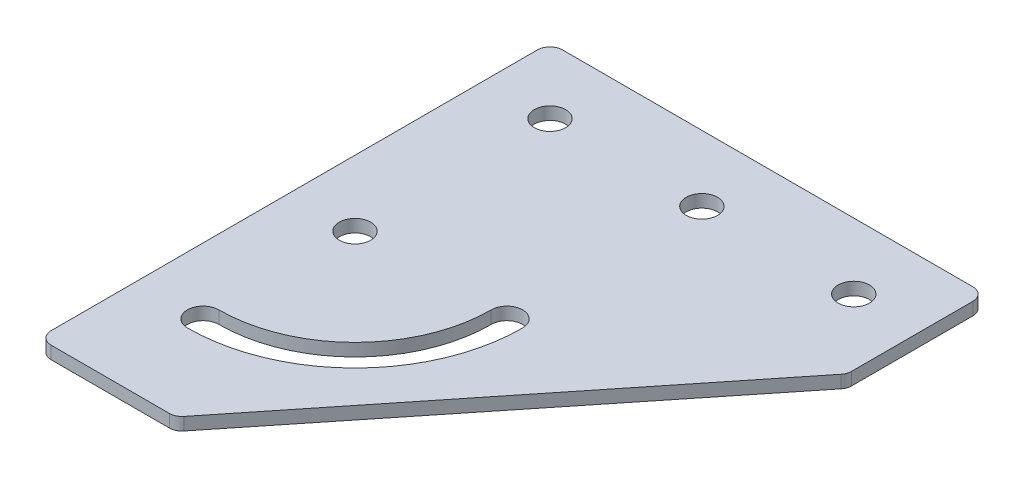
ISO-10303-21;
HEADER;
FILE_DESCRIPTION(('STEP AP214'),'2;1');
FILE_NAME('part.step','',(''),(''),'','','');
FILE_SCHEMA(('AUTOMOTIVE_DESIGN { 1 0 10303 214 1 1 1 1 }'));
ENDSEC;
DATA;
#1=APPLICATION_CONTEXT('core data for automotive mechanical design processes');
#2=APPLICATION_PROTOCOL_DEFINITION('international standard','automotive_design',2000,#1);
#3=PRODUCT_CONTEXT('',#1,'mechanical');
#4=PRODUCT('Part','Part','',(#3));
#5=PRODUCT_RELATED_PRODUCT_CATEGORY('part','',(#4));
#6=PRODUCT_DEFINITION_FORMATION('','',#4);
#7=PRODUCT_DEFINITION_CONTEXT('part definition',#1,'design');
#8=PRODUCT_DEFINITION('design','',#6,#7);
#9=PRODUCT_DEFINITION_SHAPE('','',#8);
#10=(LENGTH_UNIT() NAMED_UNIT(*) SI_UNIT(.MILLI.,.METRE.));
#11=(NAMED_UNIT(*) PLANE_ANGLE_UNIT() SI_UNIT($,.RADIAN.));
#12=(NAMED_UNIT(*) SI_UNIT($,.STERADIAN.) SOLID_ANGLE_UNIT());
#13=UNCERTAINTY_MEASURE_WITH_UNIT(LENGTH_MEASURE(1.E-05),#10,'distance_accuracy_value','');
#14=(GEOMETRIC_REPRESENTATION_CONTEXT(3) GLOBAL_UNCERTAINTY_ASSIGNED_CONTEXT((#13)) GLOBAL_UNIT_ASSIGNED_CONTEXT((#10,
#11,#12)) REPRESENTATION_CONTEXT('',''));
#15=CARTESIAN_POINT('',(0.,0.,0.));
#16=DIRECTION('',(0.,0.,1.));
#17=DIRECTION('',(1.,0.,0.));
#18=AXIS2_PLACEMENT_3D('',#15,#16,#17);
#19=CARTESIAN_POINT('',(0.,0.,0.));
#20=DIRECTION('',(0.,-1.,0.));
#21=DIRECTION('',(0.,0.,-1.));
#22=AXIS2_PLACEMENT_3D('',#19,#20,#21);
#23=PLANE('',#22);
#24=CARTESIAN_POINT('',(0.,0.,68.5));
#25=DIRECTION('',(0.,1.,0.));
#26=DIRECTION('',(0.,0.,1.));
#27=AXIS2_PLACEMENT_3D('',#24,#25,#26);
#28=CIRCLE('',#27,3.10000000000001);
#29=CARTESIAN_POINT('',(0.,0.,65.4));
#30=VERTEX_POINT('',#29);
#31=CARTESIAN_POINT('',(0.,0.,71.6));
#32=VERTEX_POINT('',#31);
#33=EDGE_CURVE('E118',#30,#32,#28,.T.);
#34=ORIENTED_EDGE('',*,*,#33,.T.);
#35=CARTESIAN_POINT('',(0.,0.,38.5));
#36=DIRECTION('',(0.,1.,0.));
#37=DIRECTION('',(0.,0.,1.));
#38=AXIS2_PLACEMENT_3D('',#35,#36,#37);
#39=CIRCLE('',#38,33.1);
#40=CARTESIAN_POINT('',(33.1,0.,38.5));
#41=VERTEX_POINT('',#40);
#42=EDGE_CURVE('E127',#32,#41,#39,.T.);
#43=ORIENTED_EDGE('',*,*,#42,.T.);
#44=CARTESIAN_POINT('',(30.,0.,38.5));
#45=DIRECTION('',(0.,1.,0.));
#46=DIRECTION('',(0.,0.,1.));
#47=AXIS2_PLACEMENT_3D('',#44,#45,#46);
#48=CIRCLE('',#47,3.1);
#49=CARTESIAN_POINT('',(26.9,0.,38.5));
#50=VERTEX_POINT('',#49);
#51=EDGE_CURVE('E31',#41,#50,#48,.T.);
#52=ORIENTED_EDGE('',*,*,#51,.T.);
#53=CARTESIAN_POINT('',(0.,0.,38.5));
#54=DIRECTION('',(0.,-1.,0.));
#55=DIRECTION('',(0.,0.,1.));
#56=AXIS2_PLACEMENT_3D('',#53,#54,#55);
#57=CIRCLE('',#56,26.9);
#58=EDGE_CURVE('E124',#50,#30,#57,.T.);
#59=ORIENTED_EDGE('',*,*,#58,.T.);
#60=EDGE_LOOP('',(#34,#43,#52,#59));
#61=FACE_BOUND('',#60,.T.);
#62=CARTESIAN_POINT('',(60.,0.,0.));
#63=DIRECTION('',(0.,1.,0.));
#64=DIRECTION('',(0.,0.,1.));
#65=AXIS2_PLACEMENT_3D('',#62,#63,#64);
#66=CIRCLE('',#65,3.1);
#67=CARTESIAN_POINT('',(60.,0.,3.1));
#68=VERTEX_POINT('',#67);
#69=EDGE_CURVE('E152',#68,#68,#66,.T.);
#70=ORIENTED_EDGE('',*,*,#69,.T.);
#71=EDGE_LOOP('',(#70));
#72=FACE_BOUND('',#71,.T.);
#73=CARTESIAN_POINT('',(0.,0.,38.5));
#74=DIRECTION('',(0.,1.,0.));
#75=DIRECTION('',(0.,0.,1.));
#76=AXIS2_PLACEMENT_3D('',#73,#74,#75);
#77=CIRCLE('',#76,3.1);
#78=CARTESIAN_POINT('',(0.,0.,41.6));
#79=VERTEX_POINT('',#78);
#80=EDGE_CURVE('E158',#79,#79,#77,.T.);
#81=ORIENTED_EDGE('',*,*,#80,.T.);
#82=EDGE_LOOP('',(#81));
#83=FACE_BOUND('',#82,.T.);
#84=CARTESIAN_POINT('',(30.,0.,0.));
#85=DIRECTION('',(0.,1.,0.));
#86=DIRECTION('',(0.,0.,1.));
#87=AXIS2_PLACEMENT_3D('',#84,#85,#86);
#88=CIRCLE('',#87,3.1);
#89=CARTESIAN_POINT('',(30.,0.,3.10000000000001));
#90=VERTEX_POINT('',#89);
#91=EDGE_CURVE('E164',#90,#90,#88,.T.);
#92=ORIENTED_EDGE('',*,*,#91,.T.);
#93=EDGE_LOOP('',(#92));
#94=FACE_BOUND('',#93,.T.);
#95=CARTESIAN_POINT('',(0.,0.,0.));
#96=DIRECTION('',(0.,1.,0.));
#97=DIRECTION('',(0.,0.,1.));
#98=AXIS2_PLACEMENT_3D('',#95,#96,#97);
#99=CIRCLE('',#98,3.1);
#100=CARTESIAN_POINT('',(0.,0.,3.1));
#101=VERTEX_POINT('',#100);
#102=EDGE_CURVE('E170',#101,#101,#99,.T.);
#103=ORIENTED_EDGE('',*,*,#102,.T.);
#104=EDGE_LOOP('',(#103));
#105=FACE_BOUND('',#104,.T.);
#106=DIRECTION('',(1.,0.,0.));
#107=VECTOR('',#106,1.);
#108=CARTESIAN_POINT('',(-13.0000000000001,0.,88.));
#109=LINE('',#108,#107);
#110=CARTESIAN_POINT('',(-10.5000000000001,0.,88.));
#111=VERTEX_POINT('',#110);
#112=CARTESIAN_POINT('',(12.8371881863105,0.,87.9999999999999));
#113=VERTEX_POINT('',#112);
#114=EDGE_CURVE('E183',#111,#113,#109,.T.);
#115=ORIENTED_EDGE('',*,*,#114,.F.);
#116=CARTESIAN_POINT('',(-10.5000000000001,0.,85.5));
#117=DIRECTION('',(0.,-1.,0.));
#118=DIRECTION('',(0.,0.,-1.));
#119=AXIS2_PLACEMENT_3D('',#116,#117,#118);
#120=CIRCLE('',#119,2.5);
#121=CARTESIAN_POINT('',(-13.0000000000001,0.,85.4999999999999));
#122=VERTEX_POINT('',#121);
#123=EDGE_CURVE('E233',#111,#122,#120,.T.);
#124=ORIENTED_EDGE('',*,*,#123,.T.);
#125=DIRECTION('',(0.,0.,1.));
#126=VECTOR('',#125,1.);
#127=CARTESIAN_POINT('',(-13.0000000000001,0.,-13.));
#128=LINE('',#127,#126);
#129=CARTESIAN_POINT('',(-13.0000000000001,0.,-10.5));
#130=VERTEX_POINT('',#129);
#131=EDGE_CURVE('E179',#130,#122,#128,.T.);
#132=ORIENTED_EDGE('',*,*,#131,.F.);
#133=CARTESIAN_POINT('',(-10.5000000000001,0.,-10.5));
#134=DIRECTION('',(0.,-1.,0.));
#135=DIRECTION('',(0.,0.,-1.));
#136=AXIS2_PLACEMENT_3D('',#133,#134,#135);
#137=CIRCLE('',#136,2.5);
#138=CARTESIAN_POINT('',(-10.5000000000001,0.,-13.));
#139=VERTEX_POINT('',#138);
#140=EDGE_CURVE('E225',#130,#139,#137,.T.);
#141=ORIENTED_EDGE('',*,*,#140,.T.);
#142=DIRECTION('',(-1.,0.,0.));
#143=VECTOR('',#142,1.);
#144=CARTESIAN_POINT('',(72.9999999999999,0.,-13.));
#145=LINE('',#144,#143);
#146=CARTESIAN_POINT('',(70.4999999999999,0.,-13.));
#147=VERTEX_POINT('',#146);
#148=EDGE_CURVE('E176',#147,#139,#145,.T.);
#149=ORIENTED_EDGE('',*,*,#148,.F.);
#150=CARTESIAN_POINT('',(70.4999999999999,0.,-10.5));
#151=DIRECTION('',(0.,-1.,0.));
#152=DIRECTION('',(0.,0.,-1.));
#153=AXIS2_PLACEMENT_3D('',#150,#151,#152);
#154=CIRCLE('',#153,2.5);
#155=CARTESIAN_POINT('',(72.9999999999999,0.,-10.5));
#156=VERTEX_POINT('',#155);
#157=EDGE_CURVE('E227',#147,#156,#154,.T.);
#158=ORIENTED_EDGE('',*,*,#157,.T.);
#159=DIRECTION('',(0.,0.,-1.));
#160=VECTOR('',#159,1.);
#161=CARTESIAN_POINT('',(72.9999999999999,0.,14.2984378812836));
#162=LINE('',#161,#160);
#163=CARTESIAN_POINT('',(72.9999999999999,0.,13.4214852328881));
#164=VERTEX_POINT('',#163);
#165=EDGE_CURVE('E189',#164,#156,#162,.T.);
#166=ORIENTED_EDGE('',*,*,#165,.F.);
#167=CARTESIAN_POINT('',(70.4999999999999,0.,13.4214852328881));
#168=DIRECTION('',(0.,-1.,0.));
#169=DIRECTION('',(0.,0.,-1.));
#170=AXIS2_PLACEMENT_3D('',#167,#168,#169);
#171=CIRCLE('',#170,2.5);
#172=CARTESIAN_POINT('',(72.4521720236074,0.,14.9832228517742));
#173=VERTEX_POINT('',#172);
#174=EDGE_CURVE('E229',#164,#173,#171,.T.);
#175=ORIENTED_EDGE('',*,*,#174,.T.);
#176=DIRECTION('',(0.624695047554423,0.,-0.780868809443031));
#177=VECTOR('',#176,1.);
#178=CARTESIAN_POINT('',(14.038750305027,0.,87.9999999999999));
#179=LINE('',#178,#177);
#180=CARTESIAN_POINT('',(14.7893602099181,0.,87.061737618886));
#181=VERTEX_POINT('',#180);
#182=EDGE_CURVE('E186',#181,#173,#179,.T.);
#183=ORIENTED_EDGE('',*,*,#182,.F.);
#184=CARTESIAN_POINT('',(12.8371881863105,0.,85.4999999999999));
#185=DIRECTION('',(0.,-1.,0.));
#186=DIRECTION('',(0.,0.,-1.));
#187=AXIS2_PLACEMENT_3D('',#184,#185,#186);
#188=CIRCLE('',#187,2.5);
#189=EDGE_CURVE('E231',#181,#113,#188,.T.);
#190=ORIENTED_EDGE('',*,*,#189,.T.);
#191=EDGE_LOOP('',(#115,#124,#132,#141,#149,#158,#166,#175,#183,#190));
#192=FACE_BOUND('',#191,.T.);
#193=ADVANCED_FACE('F16',(#61,#72,#83,#94,#105,#192),#23,.T.);
#194=CARTESIAN_POINT('',(72.9999999999999,0.,-13.));
#195=DIRECTION('',(0.,0.,-1.));
#196=DIRECTION('',(-1.,0.,0.));
#197=AXIS2_PLACEMENT_3D('',#194,#195,#196);
#198=PLANE('',#197);
#199=DIRECTION('',(-1.,0.,0.));
#200=VECTOR('',#199,1.);
#201=CARTESIAN_POINT('',(72.9999999999999,2.5,-13.));
#202=LINE('',#201,#200);
#203=CARTESIAN_POINT('',(70.4999999999999,2.5,-13.));
#204=VERTEX_POINT('',#203);
#205=CARTESIAN_POINT('',(-10.5000000000001,2.5,-13.));
#206=VERTEX_POINT('',#205);
#207=EDGE_CURVE('E173',#204,#206,#202,.T.);
#208=ORIENTED_EDGE('',*,*,#207,.F.);
#209=DIRECTION('',(0.,1.,0.));
#210=VECTOR('',#209,1.);
#211=CARTESIAN_POINT('',(70.4999999999999,0.,-13.));
#212=LINE('',#211,#210);
#213=EDGE_CURVE('E10',#204,#147,#212,.F.);
#214=ORIENTED_EDGE('',*,*,#213,.T.);
#215=ORIENTED_EDGE('',*,*,#148,.T.);
#216=DIRECTION('',(0.,1.,0.));
#217=VECTOR('',#216,1.);
#218=CARTESIAN_POINT('',(-10.5000000000001,0.,-13.));
#219=LINE('',#218,#217);
#220=EDGE_CURVE('E24',#139,#206,#219,.T.);
#221=ORIENTED_EDGE('',*,*,#220,.T.);
#222=EDGE_LOOP('',(#208,#214,#215,#221));
#223=FACE_BOUND('',#222,.T.);
#224=ADVANCED_FACE('F248',(#223),#198,.T.);
#225=CARTESIAN_POINT('',(72.9999999999999,0.,14.2984378812836));
#226=DIRECTION('',(1.,0.,0.));
#227=DIRECTION('',(0.,0.,-1.));
#228=AXIS2_PLACEMENT_3D('',#225,#226,#227);
#229=PLANE('',#228);
#230=DIRECTION('',(0.,0.,-1.));
#231=VECTOR('',#230,1.);
#232=CARTESIAN_POINT('',(72.9999999999999,2.5,14.2984378812836));
#233=LINE('',#232,#231);
#234=CARTESIAN_POINT('',(72.9999999999999,2.5,13.4214852328881));
#235=VERTEX_POINT('',#234);
#236=CARTESIAN_POINT('',(72.9999999999999,2.5,-10.5));
#237=VERTEX_POINT('',#236);
#238=EDGE_CURVE('E180',#235,#237,#233,.T.);
#239=ORIENTED_EDGE('',*,*,#238,.F.);
#240=DIRECTION('',(0.,1.,0.));
#241=VECTOR('',#240,1.);
#242=CARTESIAN_POINT('',(72.9999999999999,0.,13.4214852328881));
#243=LINE('',#242,#241);
#244=EDGE_CURVE('E243',#235,#164,#243,.F.);
#245=ORIENTED_EDGE('',*,*,#244,.T.);
#246=ORIENTED_EDGE('',*,*,#165,.T.);
#247=DIRECTION('',(0.,1.,0.));
#248=VECTOR('',#247,1.);
#249=CARTESIAN_POINT('',(72.9999999999999,0.,-10.5));
#250=LINE('',#249,#248);
#251=EDGE_CURVE('E240',#156,#237,#250,.T.);
#252=ORIENTED_EDGE('',*,*,#251,.T.);
#253=EDGE_LOOP('',(#239,#245,#246,#252));
#254=FACE_BOUND('',#253,.T.);
#255=ADVANCED_FACE('F262',(#254),#229,.T.);
#256=CARTESIAN_POINT('',(14.038750305027,0.,87.9999999999999));
#257=DIRECTION('',(0.780868809443031,0.,0.624695047554423));
#258=DIRECTION('',(0.624695047554423,0.,-0.780868809443031));
#259=AXIS2_PLACEMENT_3D('',#256,#257,#258);
#260=PLANE('',#259);
#261=DIRECTION('',(0.624695047554423,0.,-0.780868809443031));
#262=VECTOR('',#261,1.);
#263=CARTESIAN_POINT('',(14.038750305027,2.5,87.9999999999999));
#264=LINE('',#263,#262);
#265=CARTESIAN_POINT('',(14.7893602099181,2.5,87.061737618886));
#266=VERTEX_POINT('',#265);
#267=CARTESIAN_POINT('',(72.4521720236074,2.5,14.9832228517742));
#268=VERTEX_POINT('',#267);
#269=EDGE_CURVE('E201',#266,#268,#264,.T.);
#270=ORIENTED_EDGE('',*,*,#269,.F.);
#271=DIRECTION('',(0.,1.,0.));
#272=VECTOR('',#271,1.);
#273=CARTESIAN_POINT('',(14.7893602099181,0.,87.061737618886));
#274=LINE('',#273,#272);
#275=EDGE_CURVE('E238',#266,#181,#274,.F.);
#276=ORIENTED_EDGE('',*,*,#275,.T.);
#277=ORIENTED_EDGE('',*,*,#182,.T.);
#278=DIRECTION('',(0.,1.,0.));
#279=VECTOR('',#278,1.);
#280=CARTESIAN_POINT('',(72.4521720236075,0.,14.9832228517742));
#281=LINE('',#280,#279);
#282=EDGE_CURVE('E235',#173,#268,#281,.T.);
#283=ORIENTED_EDGE('',*,*,#282,.T.);
#284=EDGE_LOOP('',(#270,#276,#277,#283));
#285=FACE_BOUND('',#284,.T.);
#286=ADVANCED_FACE('F274',(#285),#260,.T.);
#287=CARTESIAN_POINT('',(-13.0000000000001,0.,88.));
#288=DIRECTION('',(0.,0.,1.));
#289=DIRECTION('',(1.,0.,0.));
#290=AXIS2_PLACEMENT_3D('',#287,#288,#289);
#291=PLANE('',#290);
#292=DIRECTION('',(1.,0.,0.));
#293=VECTOR('',#292,1.);
#294=CARTESIAN_POINT('',(-13.0000000000001,2.5,88.));
#295=LINE('',#294,#293);
#296=CARTESIAN_POINT('',(-10.5000000000001,2.5,88.));
#297=VERTEX_POINT('',#296);
#298=CARTESIAN_POINT('',(12.8371881863105,2.5,87.9999999999999));
#299=VERTEX_POINT('',#298);
#300=EDGE_CURVE('E198',#297,#299,#295,.T.);
#301=ORIENTED_EDGE('',*,*,#300,.F.);
#302=DIRECTION('',(0.,1.,0.));
#303=VECTOR('',#302,1.);
#304=CARTESIAN_POINT('',(-10.5000000000001,0.,88.));
#305=LINE('',#304,#303);
#306=EDGE_CURVE('E223',#297,#111,#305,.F.);
#307=ORIENTED_EDGE('',*,*,#306,.T.);
#308=ORIENTED_EDGE('',*,*,#114,.T.);
#309=DIRECTION('',(0.,1.,0.));
#310=VECTOR('',#309,1.);
#311=CARTESIAN_POINT('',(12.8371881863105,0.,87.9999999999999));
#312=LINE('',#311,#310);
#313=EDGE_CURVE('E220',#113,#299,#312,.T.);
#314=ORIENTED_EDGE('',*,*,#313,.T.);
#315=EDGE_LOOP('',(#301,#307,#308,#314));
#316=FACE_BOUND('',#315,.T.);
#317=ADVANCED_FACE('F282',(#316),#291,.T.);
#318=CARTESIAN_POINT('',(-13.0000000000001,0.,-13.));
#319=DIRECTION('',(-1.,0.,0.));
#320=DIRECTION('',(0.,0.,1.));
#321=AXIS2_PLACEMENT_3D('',#318,#319,#320);
#322=PLANE('',#321);
#323=ORIENTED_EDGE('',*,*,#131,.T.);
#324=DIRECTION('',(0.,1.,0.));
#325=VECTOR('',#324,1.);
#326=CARTESIAN_POINT('',(-13.0000000000001,0.,85.5));
#327=LINE('',#326,#325);
#328=CARTESIAN_POINT('',(-13.0000000000001,2.5,85.4999999999999));
#329=VERTEX_POINT('',#328);
#330=EDGE_CURVE('E207',#122,#329,#327,.T.);
#331=ORIENTED_EDGE('',*,*,#330,.T.);
#332=DIRECTION('',(0.,0.,1.));
#333=VECTOR('',#332,1.);
#334=CARTESIAN_POINT('',(-13.0000000000001,2.5,-13.));
#335=LINE('',#334,#333);
#336=CARTESIAN_POINT('',(-13.0000000000001,2.5,-10.5));
#337=VERTEX_POINT('',#336);
#338=EDGE_CURVE('E195',#337,#329,#335,.T.);
#339=ORIENTED_EDGE('',*,*,#338,.F.);
#340=DIRECTION('',(0.,1.,0.));
#341=VECTOR('',#340,1.);
#342=CARTESIAN_POINT('',(-13.0000000000001,0.,-10.5));
#343=LINE('',#342,#341);
#344=EDGE_CURVE('E192',#337,#130,#343,.F.);
#345=ORIENTED_EDGE('',*,*,#344,.T.);
#346=EDGE_LOOP('',(#323,#331,#339,#345));
#347=FACE_BOUND('',#346,.T.);
#348=ADVANCED_FACE('F290',(#347),#322,.T.);
#349=CARTESIAN_POINT('',(0.,2.5,0.));
#350=DIRECTION('',(0.,-1.,0.));
#351=DIRECTION('',(0.,0.,-1.));
#352=AXIS2_PLACEMENT_3D('',#349,#350,#351);
#353=PLANE('',#352);
#354=CARTESIAN_POINT('',(0.,2.5,38.5));
#355=DIRECTION('',(0.,1.,0.));
#356=DIRECTION('',(0.,0.,1.));
#357=AXIS2_PLACEMENT_3D('',#354,#355,#356);
#358=CIRCLE('',#357,33.1);
#359=CARTESIAN_POINT('',(0.,2.5,71.6));
#360=VERTEX_POINT('',#359);
#361=CARTESIAN_POINT('',(33.1,2.5,38.5));
#362=VERTEX_POINT('',#361);
#363=EDGE_CURVE('E142',#360,#362,#358,.T.);
#364=ORIENTED_EDGE('',*,*,#363,.F.);
#365=CARTESIAN_POINT('',(0.,2.5,68.5));
#366=DIRECTION('',(0.,1.,0.));
#367=DIRECTION('',(0.,0.,1.));
#368=AXIS2_PLACEMENT_3D('',#365,#366,#367);
#369=CIRCLE('',#368,3.10000000000001);
#370=CARTESIAN_POINT('',(0.,2.5,65.4));
#371=VERTEX_POINT('',#370);
#372=EDGE_CURVE('E39',#371,#360,#369,.T.);
#373=ORIENTED_EDGE('',*,*,#372,.F.);
#374=CARTESIAN_POINT('',(0.,2.5,38.5));
#375=DIRECTION('',(0.,-1.,0.));
#376=DIRECTION('',(0.,0.,1.));
#377=AXIS2_PLACEMENT_3D('',#374,#375,#376);
#378=CIRCLE('',#377,26.9);
#379=CARTESIAN_POINT('',(26.9,2.5,38.5));
#380=VERTEX_POINT('',#379);
#381=EDGE_CURVE('E133',#380,#371,#378,.T.);
#382=ORIENTED_EDGE('',*,*,#381,.F.);
#383=CARTESIAN_POINT('',(30.,2.5,38.5));
#384=DIRECTION('',(0.,1.,0.));
#385=DIRECTION('',(0.,0.,1.));
#386=AXIS2_PLACEMENT_3D('',#383,#384,#385);
#387=CIRCLE('',#386,3.1);
#388=EDGE_CURVE('E136',#362,#380,#387,.T.);
#389=ORIENTED_EDGE('',*,*,#388,.F.);
#390=EDGE_LOOP('',(#364,#373,#382,#389));
#391=FACE_BOUND('',#390,.T.);
#392=CARTESIAN_POINT('',(60.,2.5,0.));
#393=DIRECTION('',(0.,1.,0.));
#394=DIRECTION('',(0.,0.,1.));
#395=AXIS2_PLACEMENT_3D('',#392,#393,#394);
#396=CIRCLE('',#395,3.1);
#397=CARTESIAN_POINT('',(60.,2.5,3.1));
#398=VERTEX_POINT('',#397);
#399=EDGE_CURVE('E148',#398,#398,#396,.T.);
#400=ORIENTED_EDGE('',*,*,#399,.F.);
#401=EDGE_LOOP('',(#400));
#402=FACE_BOUND('',#401,.T.);
#403=CARTESIAN_POINT('',(0.,2.5,38.5));
#404=DIRECTION('',(0.,1.,0.));
#405=DIRECTION('',(0.,0.,1.));
#406=AXIS2_PLACEMENT_3D('',#403,#404,#405);
#407=CIRCLE('',#406,3.1);
#408=CARTESIAN_POINT('',(0.,2.5,41.6));
#409=VERTEX_POINT('',#408);
#410=EDGE_CURVE('E155',#409,#409,#407,.T.);
#411=ORIENTED_EDGE('',*,*,#410,.F.);
#412=EDGE_LOOP('',(#411));
#413=FACE_BOUND('',#412,.T.);
#414=CARTESIAN_POINT('',(30.,2.5,0.));
#415=DIRECTION('',(0.,1.,0.));
#416=DIRECTION('',(0.,0.,1.));
#417=AXIS2_PLACEMENT_3D('',#414,#415,#416);
#418=CIRCLE('',#417,3.1);
#419=CARTESIAN_POINT('',(30.,2.5,3.10000000000001));
#420=VERTEX_POINT('',#419);
#421=EDGE_CURVE('E161',#420,#420,#418,.T.);
#422=ORIENTED_EDGE('',*,*,#421,.F.);
#423=EDGE_LOOP('',(#422));
#424=FACE_BOUND('',#423,.T.);
#425=CARTESIAN_POINT('',(0.,2.5,0.));
#426=DIRECTION('',(0.,1.,0.));
#427=DIRECTION('',(0.,0.,1.));
#428=AXIS2_PLACEMENT_3D('',#425,#426,#427);
#429=CIRCLE('',#428,3.1);
#430=CARTESIAN_POINT('',(0.,2.5,3.1));
#431=VERTEX_POINT('',#430);
#432=EDGE_CURVE('E167',#431,#431,#429,.T.);
#433=ORIENTED_EDGE('',*,*,#432,.F.);
#434=EDGE_LOOP('',(#433));
#435=FACE_BOUND('',#434,.T.);
#436=ORIENTED_EDGE('',*,*,#338,.T.);
#437=CARTESIAN_POINT('',(-10.5000000000001,2.5,85.5));
#438=DIRECTION('',(0.,-1.,0.));
#439=DIRECTION('',(0.,0.,-1.));
#440=AXIS2_PLACEMENT_3D('',#437,#438,#439);
#441=CIRCLE('',#440,2.5);
#442=EDGE_CURVE('E218',#329,#297,#441,.F.);
#443=ORIENTED_EDGE('',*,*,#442,.T.);
#444=ORIENTED_EDGE('',*,*,#300,.T.);
#445=CARTESIAN_POINT('',(12.8371881863105,2.5,85.4999999999999));
#446=DIRECTION('',(0.,-1.,0.));
#447=DIRECTION('',(0.,0.,-1.));
#448=AXIS2_PLACEMENT_3D('',#445,#446,#447);
#449=CIRCLE('',#448,2.5);
#450=EDGE_CURVE('E216',#299,#266,#449,.F.);
#451=ORIENTED_EDGE('',*,*,#450,.T.);
#452=ORIENTED_EDGE('',*,*,#269,.T.);
#453=CARTESIAN_POINT('',(70.4999999999999,2.5,13.4214852328881));
#454=DIRECTION('',(0.,-1.,0.));
#455=DIRECTION('',(0.,0.,-1.));
#456=AXIS2_PLACEMENT_3D('',#453,#454,#455);
#457=CIRCLE('',#456,2.5);
#458=EDGE_CURVE('E214',#268,#235,#457,.F.);
#459=ORIENTED_EDGE('',*,*,#458,.T.);
#460=ORIENTED_EDGE('',*,*,#238,.T.);
#461=CARTESIAN_POINT('',(70.4999999999999,2.5,-10.5));
#462=DIRECTION('',(0.,-1.,0.));
#463=DIRECTION('',(0.,0.,-1.));
#464=AXIS2_PLACEMENT_3D('',#461,#462,#463);
#465=CIRCLE('',#464,2.5);
#466=EDGE_CURVE('E212',#237,#204,#465,.F.);
#467=ORIENTED_EDGE('',*,*,#466,.T.);
#468=ORIENTED_EDGE('',*,*,#207,.T.);
#469=CARTESIAN_POINT('',(-10.5000000000001,2.5,-10.5));
#470=DIRECTION('',(0.,-1.,0.));
#471=DIRECTION('',(0.,0.,-1.));
#472=AXIS2_PLACEMENT_3D('',#469,#470,#471);
#473=CIRCLE('',#472,2.5);
#474=EDGE_CURVE('E210',#206,#337,#473,.F.);
#475=ORIENTED_EDGE('',*,*,#474,.T.);
#476=EDGE_LOOP('',(#436,#443,#444,#451,#452,#459,#460,#467,#468,#475));
#477=FACE_BOUND('',#476,.T.);
#478=ADVANCED_FACE('F254',(#391,#402,#413,#424,#435,#477),#353,.F.);
#479=CARTESIAN_POINT('',(-10.5000000000001,0.,85.5));
#480=DIRECTION('',(0.,1.,0.));
#481=DIRECTION('',(0.,0.,1.));
#482=AXIS2_PLACEMENT_3D('',#479,#480,#481);
#483=CYLINDRICAL_SURFACE('',#482,2.5);
#484=ORIENTED_EDGE('',*,*,#123,.F.);
#485=ORIENTED_EDGE('',*,*,#306,.F.);
#486=ORIENTED_EDGE('',*,*,#442,.F.);
#487=ORIENTED_EDGE('',*,*,#330,.F.);
#488=EDGE_LOOP('',(#484,#485,#486,#487));
#489=FACE_BOUND('',#488,.T.);
#490=ADVANCED_FACE('F288',(#489),#483,.T.);
#491=CARTESIAN_POINT('',(12.8371881863105,0.,85.4999999999999));
#492=DIRECTION('',(0.,1.,0.));
#493=DIRECTION('',(0.,0.,1.));
#494=AXIS2_PLACEMENT_3D('',#491,#492,#493);
#495=CYLINDRICAL_SURFACE('',#494,2.5);
#496=ORIENTED_EDGE('',*,*,#189,.F.);
#497=ORIENTED_EDGE('',*,*,#275,.F.);
#498=ORIENTED_EDGE('',*,*,#450,.F.);
#499=ORIENTED_EDGE('',*,*,#313,.F.);
#500=EDGE_LOOP('',(#496,#497,#498,#499));
#501=FACE_BOUND('',#500,.T.);
#502=ADVANCED_FACE('F280',(#501),#495,.T.);
#503=CARTESIAN_POINT('',(70.4999999999999,0.,13.4214852328881));
#504=DIRECTION('',(0.,1.,0.));
#505=DIRECTION('',(0.,0.,1.));
#506=AXIS2_PLACEMENT_3D('',#503,#504,#505);
#507=CYLINDRICAL_SURFACE('',#506,2.5);
#508=ORIENTED_EDGE('',*,*,#174,.F.);
#509=ORIENTED_EDGE('',*,*,#244,.F.);
#510=ORIENTED_EDGE('',*,*,#458,.F.);
#511=ORIENTED_EDGE('',*,*,#282,.F.);
#512=EDGE_LOOP('',(#508,#509,#510,#511));
#513=FACE_BOUND('',#512,.T.);
#514=ADVANCED_FACE('F271',(#513),#507,.T.);
#515=CARTESIAN_POINT('',(70.4999999999999,0.,-10.5));
#516=DIRECTION('',(0.,1.,0.));
#517=DIRECTION('',(0.,0.,1.));
#518=AXIS2_PLACEMENT_3D('',#515,#516,#517);
#519=CYLINDRICAL_SURFACE('',#518,2.5);
#520=ORIENTED_EDGE('',*,*,#157,.F.);
#521=ORIENTED_EDGE('',*,*,#213,.F.);
#522=ORIENTED_EDGE('',*,*,#466,.F.);
#523=ORIENTED_EDGE('',*,*,#251,.F.);
#524=EDGE_LOOP('',(#520,#521,#522,#523));
#525=FACE_BOUND('',#524,.T.);
#526=ADVANCED_FACE('F260',(#525),#519,.T.);
#527=CARTESIAN_POINT('',(-10.5000000000001,0.,-10.5));
#528=DIRECTION('',(0.,1.,0.));
#529=DIRECTION('',(0.,0.,1.));
#530=AXIS2_PLACEMENT_3D('',#527,#528,#529);
#531=CYLINDRICAL_SURFACE('',#530,2.5);
#532=ORIENTED_EDGE('',*,*,#140,.F.);
#533=ORIENTED_EDGE('',*,*,#344,.F.);
#534=ORIENTED_EDGE('',*,*,#474,.F.);
#535=ORIENTED_EDGE('',*,*,#220,.F.);
#536=EDGE_LOOP('',(#532,#533,#534,#535));
#537=FACE_BOUND('',#536,.T.);
#538=ADVANCED_FACE('F18',(#537),#531,.T.);
#539=CARTESIAN_POINT('',(0.,0.,0.));
#540=DIRECTION('',(0.,1.,0.));
#541=DIRECTION('',(0.,0.,1.));
#542=AXIS2_PLACEMENT_3D('',#539,#540,#541);
#543=CYLINDRICAL_SURFACE('',#542,3.1);
#544=ORIENTED_EDGE('',*,*,#102,.F.);
#545=EDGE_LOOP('',(#544));
#546=FACE_BOUND('',#545,.T.);
#547=ORIENTED_EDGE('',*,*,#432,.T.);
#548=EDGE_LOOP('',(#547));
#549=FACE_BOUND('',#548,.T.);
#550=ADVANCED_FACE('F293',(#546,#549),#543,.F.);
#551=CARTESIAN_POINT('',(30.,0.,0.));
#552=DIRECTION('',(0.,1.,0.));
#553=DIRECTION('',(0.,0.,1.));
#554=AXIS2_PLACEMENT_3D('',#551,#552,#553);
#555=CYLINDRICAL_SURFACE('',#554,3.1);
#556=ORIENTED_EDGE('',*,*,#91,.F.);
#557=EDGE_LOOP('',(#556));
#558=FACE_BOUND('',#557,.T.);
#559=ORIENTED_EDGE('',*,*,#421,.T.);
#560=EDGE_LOOP('',(#559));
#561=FACE_BOUND('',#560,.T.);
#562=ADVANCED_FACE('F299',(#558,#561),#555,.F.);
#563=CARTESIAN_POINT('',(0.,0.,38.5));
#564=DIRECTION('',(0.,1.,0.));
#565=DIRECTION('',(0.,0.,1.));
#566=AXIS2_PLACEMENT_3D('',#563,#564,#565);
#567=CYLINDRICAL_SURFACE('',#566,3.1);
#568=ORIENTED_EDGE('',*,*,#80,.F.);
#569=EDGE_LOOP('',(#568));
#570=FACE_BOUND('',#569,.T.);
#571=ORIENTED_EDGE('',*,*,#410,.T.);
#572=EDGE_LOOP('',(#571));
#573=FACE_BOUND('',#572,.T.);
#574=ADVANCED_FACE('F350',(#570,#573),#567,.F.);
#575=CARTESIAN_POINT('',(60.,0.,0.));
#576=DIRECTION('',(0.,1.,0.));
#577=DIRECTION('',(0.,0.,1.));
#578=AXIS2_PLACEMENT_3D('',#575,#576,#577);
#579=CYLINDRICAL_SURFACE('',#578,3.1);
#580=ORIENTED_EDGE('',*,*,#69,.F.);
#581=EDGE_LOOP('',(#580));
#582=FACE_BOUND('',#581,.T.);
#583=ORIENTED_EDGE('',*,*,#399,.T.);
#584=EDGE_LOOP('',(#583));
#585=FACE_BOUND('',#584,.T.);
#586=ADVANCED_FACE('F361',(#582,#585),#579,.F.);
#587=CARTESIAN_POINT('',(0.,0.,68.5));
#588=DIRECTION('',(0.,1.,0.));
#589=DIRECTION('',(0.,0.,1.));
#590=AXIS2_PLACEMENT_3D('',#587,#588,#589);
#591=CYLINDRICAL_SURFACE('',#590,3.10000000000001);
#592=ORIENTED_EDGE('',*,*,#372,.T.);
#593=DIRECTION('',(0.,1.,0.));
#594=VECTOR('',#593,1.);
#595=CARTESIAN_POINT('',(0.,0.,71.6));
#596=LINE('',#595,#594);
#597=EDGE_CURVE('E114',#32,#360,#596,.T.);
#598=ORIENTED_EDGE('',*,*,#597,.F.);
#599=ORIENTED_EDGE('',*,*,#33,.F.);
#600=DIRECTION('',(0.,1.,0.));
#601=VECTOR('',#600,1.);
#602=CARTESIAN_POINT('',(0.,0.,65.4));
#603=LINE('',#602,#601);
#604=EDGE_CURVE('E146',#30,#371,#603,.T.);
#605=ORIENTED_EDGE('',*,*,#604,.T.);
#606=EDGE_LOOP('',(#592,#598,#599,#605));
#607=FACE_BOUND('',#606,.T.);
#608=ADVANCED_FACE('F116',(#607),#591,.F.);
#609=CARTESIAN_POINT('',(0.,0.,38.5));
#610=DIRECTION('',(0.,1.,0.));
#611=DIRECTION('',(0.,0.,1.));
#612=AXIS2_PLACEMENT_3D('',#609,#610,#611);
#613=CYLINDRICAL_SURFACE('',#612,26.9);
#614=ORIENTED_EDGE('',*,*,#381,.T.);
#615=ORIENTED_EDGE('',*,*,#604,.F.);
#616=ORIENTED_EDGE('',*,*,#58,.F.);
#617=DIRECTION('',(0.,1.,0.));
#618=VECTOR('',#617,1.);
#619=CARTESIAN_POINT('',(26.9,0.,38.5));
#620=LINE('',#619,#618);
#621=EDGE_CURVE('E149',#50,#380,#620,.T.);
#622=ORIENTED_EDGE('',*,*,#621,.T.);
#623=EDGE_LOOP('',(#614,#615,#616,#622));
#624=FACE_BOUND('',#623,.T.);
#625=ADVANCED_FACE('F380',(#624),#613,.T.);
#626=CARTESIAN_POINT('',(30.,0.,38.5));
#627=DIRECTION('',(0.,1.,0.));
#628=DIRECTION('',(0.,0.,1.));
#629=AXIS2_PLACEMENT_3D('',#626,#627,#628);
#630=CYLINDRICAL_SURFACE('',#629,3.1);
#631=ORIENTED_EDGE('',*,*,#388,.T.);
#632=ORIENTED_EDGE('',*,*,#621,.F.);
#633=ORIENTED_EDGE('',*,*,#51,.F.);
#634=DIRECTION('',(0.,1.,0.));
#635=VECTOR('',#634,1.);
#636=CARTESIAN_POINT('',(33.1,0.,38.5));
#637=LINE('',#636,#635);
#638=EDGE_CURVE('E123',#41,#362,#637,.T.);
#639=ORIENTED_EDGE('',*,*,#638,.T.);
#640=EDGE_LOOP('',(#631,#632,#633,#639));
#641=FACE_BOUND('',#640,.T.);
#642=ADVANCED_FACE('F389',(#641),#630,.F.);
#643=CARTESIAN_POINT('',(0.,0.,38.5));
#644=DIRECTION('',(0.,1.,0.));
#645=DIRECTION('',(0.,0.,1.));
#646=AXIS2_PLACEMENT_3D('',#643,#644,#645);
#647=CYLINDRICAL_SURFACE('',#646,33.1);
#648=ORIENTED_EDGE('',*,*,#363,.T.);
#649=ORIENTED_EDGE('',*,*,#638,.F.);
#650=ORIENTED_EDGE('',*,*,#42,.F.);
#651=ORIENTED_EDGE('',*,*,#597,.T.);
#652=EDGE_LOOP('',(#648,#649,#650,#651));
#653=FACE_BOUND('',#652,.T.);
#654=ADVANCED_FACE('F128',(#653),#647,.F.);
#655=CLOSED_SHELL('',(#193,#224,#255,#286,#317,#348,#478,#490,#502,#514,#526,#538,#550,#562,
#574,#586,#608,#625,#642,#654));
#656=MANIFOLD_SOLID_BREP('B1',#655);
#657=ADVANCED_BREP_SHAPE_REPRESENTATION('',(#18,#656),#14);
#658=SHAPE_DEFINITION_REPRESENTATION(#9,#657);
ENDSEC;
END-ISO-10303-21;
